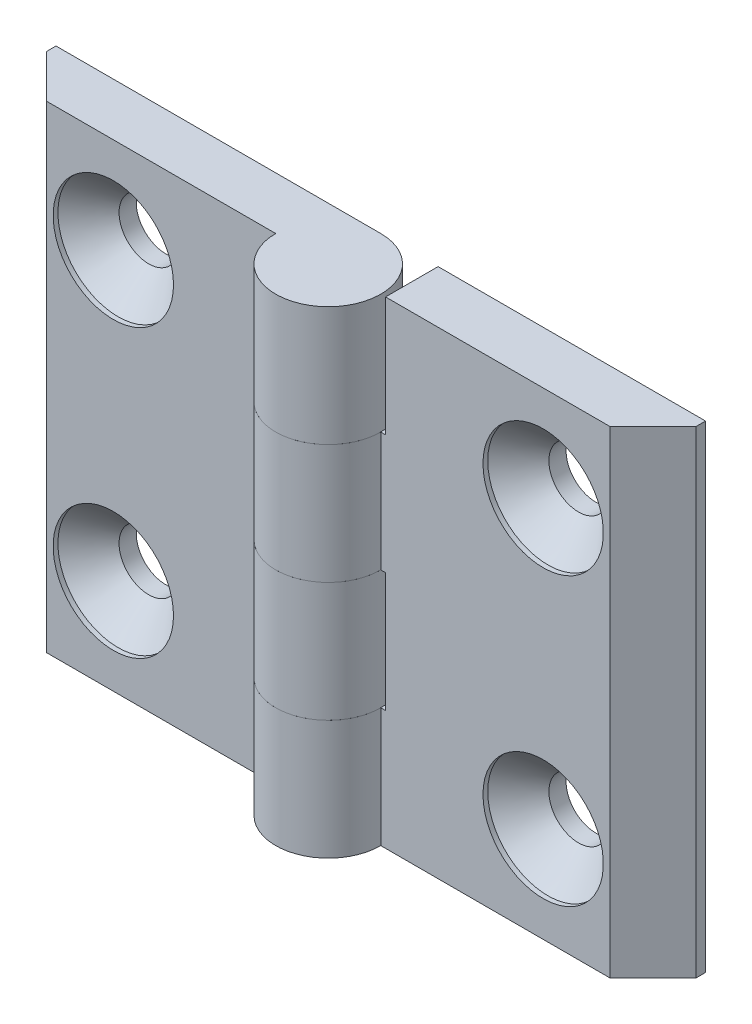
ISO-10303-21;
HEADER;
FILE_DESCRIPTION(('STEP AP214'),'2;1');
FILE_NAME('part.step','',(''),(''),'','','');
FILE_SCHEMA(('AUTOMOTIVE_DESIGN { 1 0 10303 214 1 1 1 1 }'));
ENDSEC;
DATA;
#1=APPLICATION_CONTEXT('core data for automotive mechanical design processes');
#2=APPLICATION_PROTOCOL_DEFINITION('international standard','automotive_design',2000,#1);
#3=PRODUCT_CONTEXT('',#1,'mechanical');
#4=PRODUCT('Part','Part','',(#3));
#5=PRODUCT_RELATED_PRODUCT_CATEGORY('part','',(#4));
#6=PRODUCT_DEFINITION_FORMATION('','',#4);
#7=PRODUCT_DEFINITION_CONTEXT('part definition',#1,'design');
#8=PRODUCT_DEFINITION('design','',#6,#7);
#9=PRODUCT_DEFINITION_SHAPE('','',#8);
#10=(LENGTH_UNIT() NAMED_UNIT(*) SI_UNIT(.MILLI.,.METRE.));
#11=(NAMED_UNIT(*) PLANE_ANGLE_UNIT() SI_UNIT($,.RADIAN.));
#12=(NAMED_UNIT(*) SI_UNIT($,.STERADIAN.) SOLID_ANGLE_UNIT());
#13=UNCERTAINTY_MEASURE_WITH_UNIT(LENGTH_MEASURE(1.E-05),#10,'distance_accuracy_value','');
#14=(GEOMETRIC_REPRESENTATION_CONTEXT(3) GLOBAL_UNCERTAINTY_ASSIGNED_CONTEXT((#13)) GLOBAL_UNIT_ASSIGNED_CONTEXT((#10,
#11,#12)) REPRESENTATION_CONTEXT('',''));
#15=CARTESIAN_POINT('',(0.,0.,0.));
#16=DIRECTION('',(0.,0.,1.));
#17=DIRECTION('',(1.,0.,0.));
#18=AXIS2_PLACEMENT_3D('',#15,#16,#17);
#19=CARTESIAN_POINT('',(0.,-25.,0.));
#20=DIRECTION('',(0.,1.,0.));
#21=DIRECTION('',(0.,0.,-1.));
#22=AXIS2_PLACEMENT_3D('',#19,#20,#21);
#23=CYLINDRICAL_SURFACE('',#22,5.5);
#24=DIRECTION('',(0.,1.,0.));
#25=VECTOR('',#24,1.);
#26=CARTESIAN_POINT('',(5.5,-25.,0.));
#27=LINE('',#26,#25);
#28=CARTESIAN_POINT('',(5.5,-25.,0.));
#29=VERTEX_POINT('',#28);
#30=CARTESIAN_POINT('',(5.5,-12.5,0.));
#31=VERTEX_POINT('',#30);
#32=EDGE_CURVE('E194',#29,#31,#27,.T.);
#33=ORIENTED_EDGE('',*,*,#32,.T.);
#34=CARTESIAN_POINT('',(0.,-12.5,0.));
#35=DIRECTION('',(0.,-1.,0.));
#36=DIRECTION('',(0.,0.,1.));
#37=AXIS2_PLACEMENT_3D('',#34,#35,#36);
#38=CIRCLE('',#37,5.5);
#39=CARTESIAN_POINT('',(0.,-12.5,-5.5));
#40=VERTEX_POINT('',#39);
#41=EDGE_CURVE('E171',#31,#40,#38,.T.);
#42=ORIENTED_EDGE('',*,*,#41,.T.);
#43=DIRECTION('',(0.,1.,0.));
#44=VECTOR('',#43,1.);
#45=CARTESIAN_POINT('',(0.,-25.,-5.5));
#46=LINE('',#45,#44);
#47=CARTESIAN_POINT('',(0.,-25.,-5.5));
#48=VERTEX_POINT('',#47);
#49=EDGE_CURVE('E207',#48,#40,#46,.T.);
#50=ORIENTED_EDGE('',*,*,#49,.F.);
#51=CARTESIAN_POINT('',(0.,-25.,0.));
#52=DIRECTION('',(0.,-1.,0.));
#53=DIRECTION('',(0.,0.,1.));
#54=AXIS2_PLACEMENT_3D('',#51,#52,#53);
#55=CIRCLE('',#54,5.5);
#56=EDGE_CURVE('E174',#29,#48,#55,.T.);
#57=ORIENTED_EDGE('',*,*,#56,.F.);
#58=EDGE_LOOP('',(#33,#42,#50,#57));
#59=FACE_BOUND('',#58,.T.);
#60=ADVANCED_FACE('F45',(#59),#23,.T.);
#61=CARTESIAN_POINT('',(0.,0.,-5.5));
#62=VERTEX_POINT('',#61);
#63=CARTESIAN_POINT('',(0.,12.5,-5.5));
#64=VERTEX_POINT('',#63);
#65=EDGE_CURVE('E206',#62,#64,#46,.T.);
#66=ORIENTED_EDGE('',*,*,#65,.F.);
#67=CARTESIAN_POINT('',(0.,0.,0.));
#68=DIRECTION('',(0.,1.,0.));
#69=DIRECTION('',(0.,0.,-1.));
#70=AXIS2_PLACEMENT_3D('',#67,#68,#69);
#71=CIRCLE('',#70,5.5);
#72=CARTESIAN_POINT('',(5.5,0.,0.));
#73=VERTEX_POINT('',#72);
#74=EDGE_CURVE('E142',#62,#73,#71,.T.);
#75=ORIENTED_EDGE('',*,*,#74,.T.);
#76=CARTESIAN_POINT('',(5.5,12.5,0.));
#77=VERTEX_POINT('',#76);
#78=EDGE_CURVE('E186',#73,#77,#27,.T.);
#79=ORIENTED_EDGE('',*,*,#78,.T.);
#80=CARTESIAN_POINT('',(0.,12.5,0.));
#81=DIRECTION('',(0.,-1.,0.));
#82=DIRECTION('',(1.,0.,0.));
#83=AXIS2_PLACEMENT_3D('',#80,#81,#82);
#84=CIRCLE('',#83,5.5);
#85=EDGE_CURVE('E168',#77,#64,#84,.T.);
#86=ORIENTED_EDGE('',*,*,#85,.T.);
#87=EDGE_LOOP('',(#66,#75,#79,#86));
#88=FACE_BOUND('',#87,.T.);
#89=ADVANCED_FACE('F47',(#88),#23,.T.);
#90=CARTESIAN_POINT('',(0.,-25.,-5.5));
#91=DIRECTION('',(0.,0.,1.));
#92=DIRECTION('',(-1.,0.,0.));
#93=AXIS2_PLACEMENT_3D('',#90,#91,#92);
#94=PLANE('',#93);
#95=CARTESIAN_POINT('',(22.5,-15.,-5.50000000000017));
#96=DIRECTION('',(0.,0.,1.));
#97=DIRECTION('',(-1.,0.,0.));
#98=AXIS2_PLACEMENT_3D('',#95,#96,#97);
#99=CIRCLE('',#98,3.1);
#100=CARTESIAN_POINT('',(19.4,-15.,-5.50000000000014));
#101=VERTEX_POINT('',#100);
#102=EDGE_CURVE('E377',#101,#101,#99,.T.);
#103=ORIENTED_EDGE('',*,*,#102,.T.);
#104=EDGE_LOOP('',(#103));
#105=FACE_BOUND('',#104,.T.);
#106=CARTESIAN_POINT('',(22.5,15.,-5.50000000000017));
#107=DIRECTION('',(0.,0.,1.));
#108=DIRECTION('',(-1.,0.,0.));
#109=AXIS2_PLACEMENT_3D('',#106,#107,#108);
#110=CIRCLE('',#109,3.1);
#111=CARTESIAN_POINT('',(19.4,15.,-5.50000000000014));
#112=VERTEX_POINT('',#111);
#113=EDGE_CURVE('E155',#112,#112,#110,.T.);
#114=ORIENTED_EDGE('',*,*,#113,.T.);
#115=EDGE_LOOP('',(#114));
#116=FACE_BOUND('',#115,.T.);
#117=ORIENTED_EDGE('',*,*,#49,.T.);
#118=DIRECTION('',(1.,0.,0.));
#119=VECTOR('',#118,1.);
#120=CARTESIAN_POINT('',(5.99999999999996,-12.5,-5.50000000000004));
#121=LINE('',#120,#119);
#122=CARTESIAN_POINT('',(5.99999999999996,-12.5,-5.50000000000004));
#123=VERTEX_POINT('',#122);
#124=EDGE_CURVE('E137',#40,#123,#121,.T.);
#125=ORIENTED_EDGE('',*,*,#124,.T.);
#126=DIRECTION('',(0.,1.,0.));
#127=VECTOR('',#126,1.);
#128=CARTESIAN_POINT('',(5.99999999999996,-12.5,-5.50000000000004));
#129=LINE('',#128,#127);
#130=CARTESIAN_POINT('',(5.99999999999996,0.,-5.50000000000004));
#131=VERTEX_POINT('',#130);
#132=EDGE_CURVE('E132',#123,#131,#129,.T.);
#133=ORIENTED_EDGE('',*,*,#132,.T.);
#134=DIRECTION('',(-1.,0.,0.));
#135=VECTOR('',#134,1.);
#136=CARTESIAN_POINT('',(5.99999999999996,0.,-5.50000000000004));
#137=LINE('',#136,#135);
#138=EDGE_CURVE('E140',#131,#62,#137,.T.);
#139=ORIENTED_EDGE('',*,*,#138,.T.);
#140=ORIENTED_EDGE('',*,*,#65,.T.);
#141=DIRECTION('',(1.,0.,0.));
#142=VECTOR('',#141,1.);
#143=CARTESIAN_POINT('',(-5.50000000000004,12.5,-5.49999999999996));
#144=LINE('',#143,#142);
#145=CARTESIAN_POINT('',(5.99999999999996,12.5,-5.50000000000004));
#146=VERTEX_POINT('',#145);
#147=EDGE_CURVE('E160',#64,#146,#144,.T.);
#148=ORIENTED_EDGE('',*,*,#147,.T.);
#149=DIRECTION('',(0.,1.,0.));
#150=VECTOR('',#149,1.);
#151=CARTESIAN_POINT('',(5.99999999999996,25.,-5.50000000000004));
#152=LINE('',#151,#150);
#153=CARTESIAN_POINT('',(5.99999999999996,25.,-5.50000000000004));
#154=VERTEX_POINT('',#153);
#155=EDGE_CURVE('E163',#146,#154,#152,.T.);
#156=ORIENTED_EDGE('',*,*,#155,.T.);
#157=DIRECTION('',(1.,0.,0.));
#158=VECTOR('',#157,1.);
#159=CARTESIAN_POINT('',(0.,25.,-5.5));
#160=LINE('',#159,#158);
#161=CARTESIAN_POINT('',(34.,25.,-5.50000000000025));
#162=VERTEX_POINT('',#161);
#163=EDGE_CURVE('E173',#154,#162,#160,.T.);
#164=ORIENTED_EDGE('',*,*,#163,.T.);
#165=DIRECTION('',(0.,1.,0.));
#166=VECTOR('',#165,1.);
#167=CARTESIAN_POINT('',(34.,-25.,-5.50000000000025));
#168=LINE('',#167,#166);
#169=CARTESIAN_POINT('',(34.,-25.,-5.50000000000025));
#170=VERTEX_POINT('',#169);
#171=EDGE_CURVE('E203',#170,#162,#168,.T.);
#172=ORIENTED_EDGE('',*,*,#171,.F.);
#173=DIRECTION('',(1.,0.,0.));
#174=VECTOR('',#173,1.);
#175=CARTESIAN_POINT('',(0.,-25.,-5.5));
#176=LINE('',#175,#174);
#177=EDGE_CURVE('E177',#48,#170,#176,.T.);
#178=ORIENTED_EDGE('',*,*,#177,.F.);
#179=EDGE_LOOP('',(#117,#125,#133,#139,#140,#148,#156,#164,#172,#178));
#180=FACE_BOUND('',#179,.T.);
#181=ADVANCED_FACE('F148',(#105,#116,#180),#94,.F.);
#182=CARTESIAN_POINT('',(34.,-25.,-5.50000000000025));
#183=DIRECTION('',(-1.,0.,0.));
#184=DIRECTION('',(0.,0.,-1.));
#185=AXIS2_PLACEMENT_3D('',#182,#183,#184);
#186=PLANE('',#185);
#187=DIRECTION('',(0.,0.,1.));
#188=VECTOR('',#187,1.);
#189=CARTESIAN_POINT('',(34.,25.,-5.50000000000025));
#190=LINE('',#189,#188);
#191=CARTESIAN_POINT('',(34.,25.,-4.50000000000025));
#192=VERTEX_POINT('',#191);
#193=EDGE_CURVE('E188',#162,#192,#190,.T.);
#194=ORIENTED_EDGE('',*,*,#193,.T.);
#195=DIRECTION('',(0.,1.,0.));
#196=VECTOR('',#195,1.);
#197=CARTESIAN_POINT('',(34.,-25.,-4.50000000000025));
#198=LINE('',#197,#196);
#199=CARTESIAN_POINT('',(34.,-25.,-4.50000000000025));
#200=VERTEX_POINT('',#199);
#201=EDGE_CURVE('E200',#200,#192,#198,.T.);
#202=ORIENTED_EDGE('',*,*,#201,.F.);
#203=DIRECTION('',(0.,0.,1.));
#204=VECTOR('',#203,1.);
#205=CARTESIAN_POINT('',(34.,-25.,-5.50000000000025));
#206=LINE('',#205,#204);
#207=EDGE_CURVE('E180',#170,#200,#206,.T.);
#208=ORIENTED_EDGE('',*,*,#207,.F.);
#209=ORIENTED_EDGE('',*,*,#171,.T.);
#210=EDGE_LOOP('',(#194,#202,#208,#209));
#211=FACE_BOUND('',#210,.T.);
#212=ADVANCED_FACE('F237',(#211),#186,.F.);
#213=CARTESIAN_POINT('',(34.,-25.,-4.50000000000025));
#214=DIRECTION('',(-0.707106781186549,0.,-0.707106781186546));
#215=DIRECTION('',(0.707106781186546,0.,-0.707106781186549));
#216=AXIS2_PLACEMENT_3D('',#213,#214,#215);
#217=PLANE('',#216);
#218=DIRECTION('',(-0.707106781186546,0.,0.707106781186549));
#219=VECTOR('',#218,1.);
#220=CARTESIAN_POINT('',(34.,25.,-4.50000000000025));
#221=LINE('',#220,#219);
#222=CARTESIAN_POINT('',(29.5,25.,-2.20463346970764E-13));
#223=VERTEX_POINT('',#222);
#224=EDGE_CURVE('E190',#192,#223,#221,.T.);
#225=ORIENTED_EDGE('',*,*,#224,.T.);
#226=DIRECTION('',(0.,1.,0.));
#227=VECTOR('',#226,1.);
#228=CARTESIAN_POINT('',(29.5,-25.,-2.20463346970764E-13));
#229=LINE('',#228,#227);
#230=CARTESIAN_POINT('',(29.5,-25.,-2.20463346970764E-13));
#231=VERTEX_POINT('',#230);
#232=EDGE_CURVE('E197',#231,#223,#229,.T.);
#233=ORIENTED_EDGE('',*,*,#232,.F.);
#234=DIRECTION('',(-0.707106781186546,0.,0.707106781186549));
#235=VECTOR('',#234,1.);
#236=CARTESIAN_POINT('',(34.,-25.,-4.50000000000025));
#237=LINE('',#236,#235);
#238=EDGE_CURVE('E182',#200,#231,#237,.T.);
#239=ORIENTED_EDGE('',*,*,#238,.F.);
#240=ORIENTED_EDGE('',*,*,#201,.T.);
#241=EDGE_LOOP('',(#225,#233,#239,#240));
#242=FACE_BOUND('',#241,.T.);
#243=ADVANCED_FACE('F234',(#242),#217,.F.);
#244=CARTESIAN_POINT('',(29.5,-25.,-2.20463346970764E-13));
#245=DIRECTION('',(0.,0.,-1.));
#246=DIRECTION('',(1.,0.,0.));
#247=AXIS2_PLACEMENT_3D('',#244,#245,#246);
#248=PLANE('',#247);
#249=CARTESIAN_POINT('',(22.5,-15.,-1.68355321874764E-13));
#250=DIRECTION('',(0.,0.,1.));
#251=DIRECTION('',(-1.,0.,0.));
#252=AXIS2_PLACEMENT_3D('',#249,#250,#251);
#253=CIRCLE('',#252,6.3);
#254=CARTESIAN_POINT('',(16.2,-15.,-1.21276547071489E-13));
#255=VERTEX_POINT('',#254);
#256=EDGE_CURVE('E370',#255,#255,#253,.T.);
#257=ORIENTED_EDGE('',*,*,#256,.F.);
#258=EDGE_LOOP('',(#257));
#259=FACE_BOUND('',#258,.T.);
#260=CARTESIAN_POINT('',(22.5,15.,-1.68355321874764E-13));
#261=DIRECTION('',(0.,0.,1.));
#262=DIRECTION('',(-1.,0.,0.));
#263=AXIS2_PLACEMENT_3D('',#260,#261,#262);
#264=CIRCLE('',#263,6.3);
#265=CARTESIAN_POINT('',(16.2,15.,-1.21276547071489E-13));
#266=VERTEX_POINT('',#265);
#267=EDGE_CURVE('E379',#266,#266,#264,.T.);
#268=ORIENTED_EDGE('',*,*,#267,.F.);
#269=EDGE_LOOP('',(#268));
#270=FACE_BOUND('',#269,.T.);
#271=DIRECTION('',(0.,-1.,0.));
#272=VECTOR('',#271,1.);
#273=CARTESIAN_POINT('',(6.,-25.,0.));
#274=LINE('',#273,#272);
#275=CARTESIAN_POINT('',(6.,0.,0.));
#276=VERTEX_POINT('',#275);
#277=CARTESIAN_POINT('',(6.,-12.5,0.));
#278=VERTEX_POINT('',#277);
#279=EDGE_CURVE('E53',#276,#278,#274,.T.);
#280=ORIENTED_EDGE('',*,*,#279,.T.);
#281=DIRECTION('',(-1.,0.,0.));
#282=VECTOR('',#281,1.);
#283=CARTESIAN_POINT('',(29.5,-12.5,-2.20463346970764E-13));
#284=LINE('',#283,#282);
#285=EDGE_CURVE('E12',#278,#31,#284,.T.);
#286=ORIENTED_EDGE('',*,*,#285,.T.);
#287=ORIENTED_EDGE('',*,*,#32,.F.);
#288=DIRECTION('',(-1.,0.,0.));
#289=VECTOR('',#288,1.);
#290=CARTESIAN_POINT('',(29.5,-25.,-2.20463346970764E-13));
#291=LINE('',#290,#289);
#292=EDGE_CURVE('E184',#231,#29,#291,.T.);
#293=ORIENTED_EDGE('',*,*,#292,.F.);
#294=ORIENTED_EDGE('',*,*,#232,.T.);
#295=DIRECTION('',(-1.,0.,0.));
#296=VECTOR('',#295,1.);
#297=CARTESIAN_POINT('',(29.5,25.,-2.20463346970764E-13));
#298=LINE('',#297,#296);
#299=CARTESIAN_POINT('',(6.00000000000001,25.,0.));
#300=VERTEX_POINT('',#299);
#301=EDGE_CURVE('E178',#223,#300,#298,.T.);
#302=ORIENTED_EDGE('',*,*,#301,.T.);
#303=DIRECTION('',(0.,-1.,0.));
#304=VECTOR('',#303,1.);
#305=CARTESIAN_POINT('',(5.99999999999998,-25.,0.));
#306=LINE('',#305,#304);
#307=CARTESIAN_POINT('',(6.,12.5,0.));
#308=VERTEX_POINT('',#307);
#309=EDGE_CURVE('E68',#300,#308,#306,.T.);
#310=ORIENTED_EDGE('',*,*,#309,.T.);
#311=DIRECTION('',(-1.,0.,0.));
#312=VECTOR('',#311,1.);
#313=CARTESIAN_POINT('',(29.5,12.5,-2.20463346970764E-13));
#314=LINE('',#313,#312);
#315=EDGE_CURVE('E209',#308,#77,#314,.T.);
#316=ORIENTED_EDGE('',*,*,#315,.T.);
#317=ORIENTED_EDGE('',*,*,#78,.F.);
#318=DIRECTION('',(1.,0.,0.));
#319=VECTOR('',#318,1.);
#320=CARTESIAN_POINT('',(29.5,0.,-2.20463346970764E-13));
#321=LINE('',#320,#319);
#322=EDGE_CURVE('E212',#73,#276,#321,.T.);
#323=ORIENTED_EDGE('',*,*,#322,.T.);
#324=EDGE_LOOP('',(#280,#286,#287,#293,#294,#302,#310,#316,#317,#323));
#325=FACE_BOUND('',#324,.T.);
#326=ADVANCED_FACE('F214',(#259,#270,#325),#248,.F.);
#327=CARTESIAN_POINT('',(0.,-25.,0.));
#328=DIRECTION('',(0.,-1.,0.));
#329=DIRECTION('',(0.,0.,1.));
#330=AXIS2_PLACEMENT_3D('',#327,#328,#329);
#331=PLANE('',#330);
#332=ORIENTED_EDGE('',*,*,#56,.T.);
#333=ORIENTED_EDGE('',*,*,#177,.T.);
#334=ORIENTED_EDGE('',*,*,#207,.T.);
#335=ORIENTED_EDGE('',*,*,#238,.T.);
#336=ORIENTED_EDGE('',*,*,#292,.T.);
#337=EDGE_LOOP('',(#332,#333,#334,#335,#336));
#338=FACE_BOUND('',#337,.T.);
#339=ADVANCED_FACE('F243',(#338),#331,.T.);
#340=CARTESIAN_POINT('',(0.,25.,0.));
#341=DIRECTION('',(0.,-1.,0.));
#342=DIRECTION('',(0.,0.,1.));
#343=AXIS2_PLACEMENT_3D('',#340,#341,#342);
#344=PLANE('',#343);
#345=ORIENTED_EDGE('',*,*,#163,.F.);
#346=DIRECTION('',(0.,0.,1.));
#347=VECTOR('',#346,1.);
#348=CARTESIAN_POINT('',(5.99999999999996,25.,-5.50000000000004));
#349=LINE('',#348,#347);
#350=EDGE_CURVE('E150',#154,#300,#349,.T.);
#351=ORIENTED_EDGE('',*,*,#350,.T.);
#352=ORIENTED_EDGE('',*,*,#301,.F.);
#353=ORIENTED_EDGE('',*,*,#224,.F.);
#354=ORIENTED_EDGE('',*,*,#193,.F.);
#355=EDGE_LOOP('',(#345,#351,#352,#353,#354));
#356=FACE_BOUND('',#355,.T.);
#357=ADVANCED_FACE('F227',(#356),#344,.F.);
#358=CARTESIAN_POINT('',(-5.50000000000004,12.5,-5.49999999999996));
#359=DIRECTION('',(0.,-1.,0.));
#360=DIRECTION('',(1.,0.,0.));
#361=AXIS2_PLACEMENT_3D('',#358,#359,#360);
#362=PLANE('',#361);
#363=ORIENTED_EDGE('',*,*,#85,.F.);
#364=ORIENTED_EDGE('',*,*,#315,.F.);
#365=DIRECTION('',(0.,0.,1.));
#366=VECTOR('',#365,1.);
#367=CARTESIAN_POINT('',(5.99999999999996,12.5,-5.50000000000004));
#368=LINE('',#367,#366);
#369=EDGE_CURVE('E152',#146,#308,#368,.T.);
#370=ORIENTED_EDGE('',*,*,#369,.F.);
#371=ORIENTED_EDGE('',*,*,#147,.F.);
#372=EDGE_LOOP('',(#363,#364,#370,#371));
#373=FACE_BOUND('',#372,.T.);
#374=ADVANCED_FACE('F223',(#373),#362,.F.);
#375=CARTESIAN_POINT('',(5.99999999999996,25.,-5.50000000000004));
#376=DIRECTION('',(1.,0.,0.));
#377=DIRECTION('',(0.,1.,0.));
#378=AXIS2_PLACEMENT_3D('',#375,#376,#377);
#379=PLANE('',#378);
#380=ORIENTED_EDGE('',*,*,#350,.F.);
#381=ORIENTED_EDGE('',*,*,#155,.F.);
#382=ORIENTED_EDGE('',*,*,#369,.T.);
#383=ORIENTED_EDGE('',*,*,#309,.F.);
#384=EDGE_LOOP('',(#380,#381,#382,#383));
#385=FACE_BOUND('',#384,.T.);
#386=ADVANCED_FACE('F224',(#385),#379,.F.);
#387=CARTESIAN_POINT('',(5.99999999999996,-12.5,-5.50000000000004));
#388=DIRECTION('',(1.,0.,0.));
#389=DIRECTION('',(0.,1.,0.));
#390=AXIS2_PLACEMENT_3D('',#387,#388,#389);
#391=PLANE('',#390);
#392=DIRECTION('',(0.,0.,1.));
#393=VECTOR('',#392,1.);
#394=CARTESIAN_POINT('',(5.99999999999996,0.,-5.50000000000004));
#395=LINE('',#394,#393);
#396=EDGE_CURVE('E60',#131,#276,#395,.T.);
#397=ORIENTED_EDGE('',*,*,#396,.F.);
#398=ORIENTED_EDGE('',*,*,#132,.F.);
#399=DIRECTION('',(0.,0.,1.));
#400=VECTOR('',#399,1.);
#401=CARTESIAN_POINT('',(5.99999999999996,-12.5,-5.50000000000004));
#402=LINE('',#401,#400);
#403=EDGE_CURVE('E136',#123,#278,#402,.T.);
#404=ORIENTED_EDGE('',*,*,#403,.T.);
#405=ORIENTED_EDGE('',*,*,#279,.F.);
#406=EDGE_LOOP('',(#397,#398,#404,#405));
#407=FACE_BOUND('',#406,.T.);
#408=ADVANCED_FACE('F129',(#407),#391,.F.);
#409=CARTESIAN_POINT('',(5.99999999999996,-12.5,-5.50000000000004));
#410=DIRECTION('',(0.,-1.,0.));
#411=DIRECTION('',(0.,0.,1.));
#412=AXIS2_PLACEMENT_3D('',#409,#410,#411);
#413=PLANE('',#412);
#414=ORIENTED_EDGE('',*,*,#41,.F.);
#415=ORIENTED_EDGE('',*,*,#285,.F.);
#416=ORIENTED_EDGE('',*,*,#403,.F.);
#417=ORIENTED_EDGE('',*,*,#124,.F.);
#418=EDGE_LOOP('',(#414,#415,#416,#417));
#419=FACE_BOUND('',#418,.T.);
#420=ADVANCED_FACE('F246',(#419),#413,.F.);
#421=CARTESIAN_POINT('',(5.99999999999996,0.,-5.50000000000004));
#422=DIRECTION('',(0.,1.,0.));
#423=DIRECTION('',(0.,0.,-1.));
#424=AXIS2_PLACEMENT_3D('',#421,#422,#423);
#425=PLANE('',#424);
#426=ORIENTED_EDGE('',*,*,#138,.F.);
#427=ORIENTED_EDGE('',*,*,#396,.T.);
#428=ORIENTED_EDGE('',*,*,#322,.F.);
#429=ORIENTED_EDGE('',*,*,#74,.F.);
#430=EDGE_LOOP('',(#426,#427,#428,#429));
#431=FACE_BOUND('',#430,.T.);
#432=ADVANCED_FACE('F141',(#431),#425,.F.);
#433=CARTESIAN_POINT('',(22.5,15.,-1.68138481440267E-13));
#434=DIRECTION('',(0.,0.,1.));
#435=DIRECTION('',(-1.,0.,0.));
#436=AXIS2_PLACEMENT_3D('',#433,#434,#435);
#437=CYLINDRICAL_SURFACE('',#436,3.1);
#438=ORIENTED_EDGE('',*,*,#113,.F.);
#439=EDGE_LOOP('',(#438));
#440=FACE_BOUND('',#439,.T.);
#441=CARTESIAN_POINT('',(22.5,15.,-3.70000000000017));
#442=DIRECTION('',(0.,0.,1.));
#443=DIRECTION('',(-1.,0.,0.));
#444=AXIS2_PLACEMENT_3D('',#441,#442,#443);
#445=CIRCLE('',#444,3.1);
#446=CARTESIAN_POINT('',(19.4,15.,-3.70000000000014));
#447=VERTEX_POINT('',#446);
#448=EDGE_CURVE('E384',#447,#447,#445,.T.);
#449=ORIENTED_EDGE('',*,*,#448,.T.);
#450=EDGE_LOOP('',(#449));
#451=FACE_BOUND('',#450,.T.);
#452=ADVANCED_FACE('F253',(#440,#451),#437,.F.);
#453=CARTESIAN_POINT('',(22.5,15.,-0.500000000000168));
#454=DIRECTION('',(0.,0.,1.));
#455=DIRECTION('',(-1.,0.,0.));
#456=AXIS2_PLACEMENT_3D('',#453,#454,#455);
#457=CONICAL_SURFACE('',#456,6.3,0.785398163397449);
#458=ORIENTED_EDGE('',*,*,#448,.F.);
#459=EDGE_LOOP('',(#458));
#460=FACE_BOUND('',#459,.T.);
#461=CARTESIAN_POINT('',(22.5,15.,-0.500000000000168));
#462=DIRECTION('',(0.,0.,1.));
#463=DIRECTION('',(-1.,0.,0.));
#464=AXIS2_PLACEMENT_3D('',#461,#462,#463);
#465=CIRCLE('',#464,6.3);
#466=CARTESIAN_POINT('',(16.2,15.,-0.500000000000121));
#467=VERTEX_POINT('',#466);
#468=EDGE_CURVE('E382',#467,#467,#465,.T.);
#469=ORIENTED_EDGE('',*,*,#468,.T.);
#470=EDGE_LOOP('',(#469));
#471=FACE_BOUND('',#470,.T.);
#472=ADVANCED_FACE('F311',(#460,#471),#457,.F.);
#473=CARTESIAN_POINT('',(22.5,15.,-1.68138481440267E-13));
#474=DIRECTION('',(0.,0.,1.));
#475=DIRECTION('',(-1.,0.,0.));
#476=AXIS2_PLACEMENT_3D('',#473,#474,#475);
#477=CYLINDRICAL_SURFACE('',#476,6.3);
#478=ORIENTED_EDGE('',*,*,#468,.F.);
#479=EDGE_LOOP('',(#478));
#480=FACE_BOUND('',#479,.T.);
#481=ORIENTED_EDGE('',*,*,#267,.T.);
#482=EDGE_LOOP('',(#481));
#483=FACE_BOUND('',#482,.T.);
#484=ADVANCED_FACE('F320',(#480,#483),#477,.F.);
#485=CARTESIAN_POINT('',(22.5,-15.,-1.68138481440267E-13));
#486=DIRECTION('',(0.,0.,1.));
#487=DIRECTION('',(-1.,0.,0.));
#488=AXIS2_PLACEMENT_3D('',#485,#486,#487);
#489=CYLINDRICAL_SURFACE('',#488,3.1);
#490=ORIENTED_EDGE('',*,*,#102,.F.);
#491=EDGE_LOOP('',(#490));
#492=FACE_BOUND('',#491,.T.);
#493=CARTESIAN_POINT('',(22.5,-15.,-3.70000000000017));
#494=DIRECTION('',(0.,0.,1.));
#495=DIRECTION('',(-1.,0.,0.));
#496=AXIS2_PLACEMENT_3D('',#493,#494,#495);
#497=CIRCLE('',#496,3.1);
#498=CARTESIAN_POINT('',(19.4,-15.,-3.70000000000014));
#499=VERTEX_POINT('',#498);
#500=EDGE_CURVE('E372',#499,#499,#497,.T.);
#501=ORIENTED_EDGE('',*,*,#500,.T.);
#502=EDGE_LOOP('',(#501));
#503=FACE_BOUND('',#502,.T.);
#504=ADVANCED_FACE('F330',(#492,#503),#489,.F.);
#505=CARTESIAN_POINT('',(22.5,-15.,-0.500000000000168));
#506=DIRECTION('',(0.,0.,1.));
#507=DIRECTION('',(-1.,0.,0.));
#508=AXIS2_PLACEMENT_3D('',#505,#506,#507);
#509=CONICAL_SURFACE('',#508,6.3,0.785398163397449);
#510=ORIENTED_EDGE('',*,*,#500,.F.);
#511=EDGE_LOOP('',(#510));
#512=FACE_BOUND('',#511,.T.);
#513=CARTESIAN_POINT('',(22.5,-15.,-0.500000000000168));
#514=DIRECTION('',(0.,0.,1.));
#515=DIRECTION('',(-1.,0.,0.));
#516=AXIS2_PLACEMENT_3D('',#513,#514,#515);
#517=CIRCLE('',#516,6.3);
#518=CARTESIAN_POINT('',(16.2,-15.,-0.500000000000121));
#519=VERTEX_POINT('',#518);
#520=EDGE_CURVE('E367',#519,#519,#517,.T.);
#521=ORIENTED_EDGE('',*,*,#520,.T.);
#522=EDGE_LOOP('',(#521));
#523=FACE_BOUND('',#522,.T.);
#524=ADVANCED_FACE('F340',(#512,#523),#509,.F.);
#525=CARTESIAN_POINT('',(22.5,-15.,-1.68138481440267E-13));
#526=DIRECTION('',(0.,0.,1.));
#527=DIRECTION('',(-1.,0.,0.));
#528=AXIS2_PLACEMENT_3D('',#525,#526,#527);
#529=CYLINDRICAL_SURFACE('',#528,6.3);
#530=ORIENTED_EDGE('',*,*,#520,.F.);
#531=EDGE_LOOP('',(#530));
#532=FACE_BOUND('',#531,.T.);
#533=ORIENTED_EDGE('',*,*,#256,.T.);
#534=EDGE_LOOP('',(#533));
#535=FACE_BOUND('',#534,.T.);
#536=ADVANCED_FACE('F350',(#532,#535),#529,.F.);
#537=CLOSED_SHELL('',(#60,#89,#181,#212,#243,#326,#339,#357,#374,#386,#408,#420,#432,#452,#472,
#484,#504,#524,#536));
#538=MANIFOLD_SOLID_BREP('B2',#537);
#539=CARTESIAN_POINT('',(0.,25.,0.));
#540=DIRECTION('',(0.,-1.,0.));
#541=DIRECTION('',(0.,0.,-1.));
#542=AXIS2_PLACEMENT_3D('',#539,#540,#541);
#543=CYLINDRICAL_SURFACE('',#542,5.5);
#544=DIRECTION('',(0.,-1.,0.));
#545=VECTOR('',#544,1.);
#546=CARTESIAN_POINT('',(-5.5,25.,0.));
#547=LINE('',#546,#545);
#548=CARTESIAN_POINT('',(-5.5,25.,0.));
#549=VERTEX_POINT('',#548);
#550=CARTESIAN_POINT('',(-5.5,12.5,0.));
#551=VERTEX_POINT('',#550);
#552=EDGE_CURVE('E599',#549,#551,#547,.T.);
#553=ORIENTED_EDGE('',*,*,#552,.T.);
#554=CARTESIAN_POINT('',(0.,12.5,0.));
#555=DIRECTION('',(0.,1.,0.));
#556=DIRECTION('',(0.,0.,1.));
#557=AXIS2_PLACEMENT_3D('',#554,#555,#556);
#558=CIRCLE('',#557,5.5);
#559=CARTESIAN_POINT('',(0.,12.5,-5.5));
#560=VERTEX_POINT('',#559);
#561=EDGE_CURVE('E576',#551,#560,#558,.T.);
#562=ORIENTED_EDGE('',*,*,#561,.T.);
#563=DIRECTION('',(0.,-1.,0.));
#564=VECTOR('',#563,1.);
#565=CARTESIAN_POINT('',(0.,25.,-5.5));
#566=LINE('',#565,#564);
#567=CARTESIAN_POINT('',(0.,25.,-5.5));
#568=VERTEX_POINT('',#567);
#569=EDGE_CURVE('E612',#568,#560,#566,.T.);
#570=ORIENTED_EDGE('',*,*,#569,.F.);
#571=CARTESIAN_POINT('',(0.,25.,0.));
#572=DIRECTION('',(0.,1.,0.));
#573=DIRECTION('',(0.,0.,1.));
#574=AXIS2_PLACEMENT_3D('',#571,#572,#573);
#575=CIRCLE('',#574,5.5);
#576=EDGE_CURVE('E579',#549,#568,#575,.T.);
#577=ORIENTED_EDGE('',*,*,#576,.F.);
#578=EDGE_LOOP('',(#553,#562,#570,#577));
#579=FACE_BOUND('',#578,.T.);
#580=ADVANCED_FACE('F450',(#579),#543,.T.);
#581=CARTESIAN_POINT('',(0.,0.,-5.5));
#582=VERTEX_POINT('',#581);
#583=CARTESIAN_POINT('',(0.,-12.5,-5.5));
#584=VERTEX_POINT('',#583);
#585=EDGE_CURVE('E611',#582,#584,#566,.T.);
#586=ORIENTED_EDGE('',*,*,#585,.F.);
#587=CARTESIAN_POINT('',(0.,0.,0.));
#588=DIRECTION('',(0.,-1.,0.));
#589=DIRECTION('',(0.,0.,-1.));
#590=AXIS2_PLACEMENT_3D('',#587,#588,#589);
#591=CIRCLE('',#590,5.5);
#592=CARTESIAN_POINT('',(-5.5,0.,0.));
#593=VERTEX_POINT('',#592);
#594=EDGE_CURVE('E547',#582,#593,#591,.T.);
#595=ORIENTED_EDGE('',*,*,#594,.T.);
#596=CARTESIAN_POINT('',(-5.5,-12.5,0.));
#597=VERTEX_POINT('',#596);
#598=EDGE_CURVE('E591',#593,#597,#547,.T.);
#599=ORIENTED_EDGE('',*,*,#598,.T.);
#600=CARTESIAN_POINT('',(0.,-12.5,0.));
#601=DIRECTION('',(0.,1.,0.));
#602=DIRECTION('',(-1.,0.,0.));
#603=AXIS2_PLACEMENT_3D('',#600,#601,#602);
#604=CIRCLE('',#603,5.5);
#605=EDGE_CURVE('E573',#597,#584,#604,.T.);
#606=ORIENTED_EDGE('',*,*,#605,.T.);
#607=EDGE_LOOP('',(#586,#595,#599,#606));
#608=FACE_BOUND('',#607,.T.);
#609=ADVANCED_FACE('F452',(#608),#543,.T.);
#610=CARTESIAN_POINT('',(0.,25.,-5.5));
#611=DIRECTION('',(0.,0.,1.));
#612=DIRECTION('',(1.,0.,0.));
#613=AXIS2_PLACEMENT_3D('',#610,#611,#612);
#614=PLANE('',#613);
#615=CARTESIAN_POINT('',(-22.5,15.,-5.5));
#616=DIRECTION('',(0.,0.,1.));
#617=DIRECTION('',(1.,0.,0.));
#618=AXIS2_PLACEMENT_3D('',#615,#616,#617);
#619=CIRCLE('',#618,3.1);
#620=CARTESIAN_POINT('',(-19.4,15.,-5.5));
#621=VERTEX_POINT('',#620);
#622=EDGE_CURVE('E796',#621,#621,#619,.T.);
#623=ORIENTED_EDGE('',*,*,#622,.T.);
#624=EDGE_LOOP('',(#623));
#625=FACE_BOUND('',#624,.T.);
#626=CARTESIAN_POINT('',(-22.5,-15.,-5.5));
#627=DIRECTION('',(0.,0.,1.));
#628=DIRECTION('',(1.,0.,0.));
#629=AXIS2_PLACEMENT_3D('',#626,#627,#628);
#630=CIRCLE('',#629,3.1);
#631=CARTESIAN_POINT('',(-19.4,-15.,-5.5));
#632=VERTEX_POINT('',#631);
#633=EDGE_CURVE('E560',#632,#632,#630,.T.);
#634=ORIENTED_EDGE('',*,*,#633,.T.);
#635=EDGE_LOOP('',(#634));
#636=FACE_BOUND('',#635,.T.);
#637=ORIENTED_EDGE('',*,*,#569,.T.);
#638=DIRECTION('',(-1.,0.,0.));
#639=VECTOR('',#638,1.);
#640=CARTESIAN_POINT('',(-6.,12.5,-5.5));
#641=LINE('',#640,#639);
#642=CARTESIAN_POINT('',(-6.,12.5,-5.5));
#643=VERTEX_POINT('',#642);
#644=EDGE_CURVE('E542',#560,#643,#641,.T.);
#645=ORIENTED_EDGE('',*,*,#644,.T.);
#646=DIRECTION('',(0.,-1.,0.));
#647=VECTOR('',#646,1.);
#648=CARTESIAN_POINT('',(-6.,12.5,-5.5));
#649=LINE('',#648,#647);
#650=CARTESIAN_POINT('',(-6.,0.,-5.5));
#651=VERTEX_POINT('',#650);
#652=EDGE_CURVE('E537',#643,#651,#649,.T.);
#653=ORIENTED_EDGE('',*,*,#652,.T.);
#654=DIRECTION('',(1.,0.,0.));
#655=VECTOR('',#654,1.);
#656=CARTESIAN_POINT('',(-6.,0.,-5.5));
#657=LINE('',#656,#655);
#658=EDGE_CURVE('E545',#651,#582,#657,.T.);
#659=ORIENTED_EDGE('',*,*,#658,.T.);
#660=ORIENTED_EDGE('',*,*,#585,.T.);
#661=DIRECTION('',(-1.,0.,0.));
#662=VECTOR('',#661,1.);
#663=CARTESIAN_POINT('',(5.5,-12.5,-5.5));
#664=LINE('',#663,#662);
#665=CARTESIAN_POINT('',(-6.,-12.5,-5.5));
#666=VERTEX_POINT('',#665);
#667=EDGE_CURVE('E565',#584,#666,#664,.T.);
#668=ORIENTED_EDGE('',*,*,#667,.T.);
#669=DIRECTION('',(0.,-1.,0.));
#670=VECTOR('',#669,1.);
#671=CARTESIAN_POINT('',(-6.,-25.,-5.5));
#672=LINE('',#671,#670);
#673=CARTESIAN_POINT('',(-6.,-25.,-5.5));
#674=VERTEX_POINT('',#673);
#675=EDGE_CURVE('E568',#666,#674,#672,.T.);
#676=ORIENTED_EDGE('',*,*,#675,.T.);
#677=DIRECTION('',(-1.,0.,0.));
#678=VECTOR('',#677,1.);
#679=CARTESIAN_POINT('',(0.,-25.,-5.5));
#680=LINE('',#679,#678);
#681=CARTESIAN_POINT('',(-34.,-25.,-5.5));
#682=VERTEX_POINT('',#681);
#683=EDGE_CURVE('E578',#674,#682,#680,.T.);
#684=ORIENTED_EDGE('',*,*,#683,.T.);
#685=DIRECTION('',(0.,-1.,0.));
#686=VECTOR('',#685,1.);
#687=CARTESIAN_POINT('',(-34.,25.,-5.5));
#688=LINE('',#687,#686);
#689=CARTESIAN_POINT('',(-34.,25.,-5.5));
#690=VERTEX_POINT('',#689);
#691=EDGE_CURVE('E608',#690,#682,#688,.T.);
#692=ORIENTED_EDGE('',*,*,#691,.F.);
#693=DIRECTION('',(-1.,0.,0.));
#694=VECTOR('',#693,1.);
#695=CARTESIAN_POINT('',(0.,25.,-5.5));
#696=LINE('',#695,#694);
#697=EDGE_CURVE('E582',#568,#690,#696,.T.);
#698=ORIENTED_EDGE('',*,*,#697,.F.);
#699=EDGE_LOOP('',(#637,#645,#653,#659,#660,#668,#676,#684,#692,#698));
#700=FACE_BOUND('',#699,.T.);
#701=ADVANCED_FACE('F553',(#625,#636,#700),#614,.F.);
#702=CARTESIAN_POINT('',(-34.,25.,-5.5));
#703=DIRECTION('',(1.,0.,0.));
#704=DIRECTION('',(0.,0.,-1.));
#705=AXIS2_PLACEMENT_3D('',#702,#703,#704);
#706=PLANE('',#705);
#707=DIRECTION('',(0.,0.,1.));
#708=VECTOR('',#707,1.);
#709=CARTESIAN_POINT('',(-34.,-25.,-5.5));
#710=LINE('',#709,#708);
#711=CARTESIAN_POINT('',(-34.,-25.,-4.5));
#712=VERTEX_POINT('',#711);
#713=EDGE_CURVE('E593',#682,#712,#710,.T.);
#714=ORIENTED_EDGE('',*,*,#713,.T.);
#715=DIRECTION('',(0.,-1.,0.));
#716=VECTOR('',#715,1.);
#717=CARTESIAN_POINT('',(-34.,25.,-4.5));
#718=LINE('',#717,#716);
#719=CARTESIAN_POINT('',(-34.,25.,-4.5));
#720=VERTEX_POINT('',#719);
#721=EDGE_CURVE('E605',#720,#712,#718,.T.);
#722=ORIENTED_EDGE('',*,*,#721,.F.);
#723=DIRECTION('',(0.,0.,1.));
#724=VECTOR('',#723,1.);
#725=CARTESIAN_POINT('',(-34.,25.,-5.5));
#726=LINE('',#725,#724);
#727=EDGE_CURVE('E585',#690,#720,#726,.T.);
#728=ORIENTED_EDGE('',*,*,#727,.F.);
#729=ORIENTED_EDGE('',*,*,#691,.T.);
#730=EDGE_LOOP('',(#714,#722,#728,#729));
#731=FACE_BOUND('',#730,.T.);
#732=ADVANCED_FACE('F642',(#731),#706,.F.);
#733=CARTESIAN_POINT('',(-34.,25.,-4.5));
#734=DIRECTION('',(0.707106781186544,0.,-0.707106781186552));
#735=DIRECTION('',(-0.707106781186551,0.,-0.707106781186544));
#736=AXIS2_PLACEMENT_3D('',#733,#734,#735);
#737=PLANE('',#736);
#738=DIRECTION('',(0.707106781186552,0.,0.707106781186544));
#739=VECTOR('',#738,1.);
#740=CARTESIAN_POINT('',(-34.,-25.,-4.5));
#741=LINE('',#740,#739);
#742=CARTESIAN_POINT('',(-29.5,-25.,0.));
#743=VERTEX_POINT('',#742);
#744=EDGE_CURVE('E595',#712,#743,#741,.T.);
#745=ORIENTED_EDGE('',*,*,#744,.T.);
#746=DIRECTION('',(0.,-1.,0.));
#747=VECTOR('',#746,1.);
#748=CARTESIAN_POINT('',(-29.5,25.,0.));
#749=LINE('',#748,#747);
#750=CARTESIAN_POINT('',(-29.5,25.,0.));
#751=VERTEX_POINT('',#750);
#752=EDGE_CURVE('E602',#751,#743,#749,.T.);
#753=ORIENTED_EDGE('',*,*,#752,.F.);
#754=DIRECTION('',(0.707106781186552,0.,0.707106781186544));
#755=VECTOR('',#754,1.);
#756=CARTESIAN_POINT('',(-34.,25.,-4.5));
#757=LINE('',#756,#755);
#758=EDGE_CURVE('E587',#720,#751,#757,.T.);
#759=ORIENTED_EDGE('',*,*,#758,.F.);
#760=ORIENTED_EDGE('',*,*,#721,.T.);
#761=EDGE_LOOP('',(#745,#753,#759,#760));
#762=FACE_BOUND('',#761,.T.);
#763=ADVANCED_FACE('F639',(#762),#737,.F.);
#764=CARTESIAN_POINT('',(-29.5,25.,0.));
#765=DIRECTION('',(0.,0.,-1.));
#766=DIRECTION('',(-1.,0.,0.));
#767=AXIS2_PLACEMENT_3D('',#764,#765,#766);
#768=PLANE('',#767);
#769=CARTESIAN_POINT('',(-22.5,15.,0.));
#770=DIRECTION('',(0.,0.,1.));
#771=DIRECTION('',(1.,0.,0.));
#772=AXIS2_PLACEMENT_3D('',#769,#770,#771);
#773=CIRCLE('',#772,6.3);
#774=CARTESIAN_POINT('',(-16.2,15.,0.));
#775=VERTEX_POINT('',#774);
#776=EDGE_CURVE('E789',#775,#775,#773,.T.);
#777=ORIENTED_EDGE('',*,*,#776,.F.);
#778=EDGE_LOOP('',(#777));
#779=FACE_BOUND('',#778,.T.);
#780=CARTESIAN_POINT('',(-22.5,-15.,0.));
#781=DIRECTION('',(0.,0.,1.));
#782=DIRECTION('',(1.,0.,0.));
#783=AXIS2_PLACEMENT_3D('',#780,#781,#782);
#784=CIRCLE('',#783,6.3);
#785=CARTESIAN_POINT('',(-16.2,-15.,0.));
#786=VERTEX_POINT('',#785);
#787=EDGE_CURVE('E798',#786,#786,#784,.T.);
#788=ORIENTED_EDGE('',*,*,#787,.F.);
#789=EDGE_LOOP('',(#788));
#790=FACE_BOUND('',#789,.T.);
#791=DIRECTION('',(0.,1.,0.));
#792=VECTOR('',#791,1.);
#793=CARTESIAN_POINT('',(-6.,25.,0.));
#794=LINE('',#793,#792);
#795=CARTESIAN_POINT('',(-6.,0.,0.));
#796=VERTEX_POINT('',#795);
#797=CARTESIAN_POINT('',(-6.,12.5,0.));
#798=VERTEX_POINT('',#797);
#799=EDGE_CURVE('E458',#796,#798,#794,.T.);
#800=ORIENTED_EDGE('',*,*,#799,.T.);
#801=DIRECTION('',(1.,0.,0.));
#802=VECTOR('',#801,1.);
#803=CARTESIAN_POINT('',(-29.5,12.5,0.));
#804=LINE('',#803,#802);
#805=EDGE_CURVE('E43',#798,#551,#804,.T.);
#806=ORIENTED_EDGE('',*,*,#805,.T.);
#807=ORIENTED_EDGE('',*,*,#552,.F.);
#808=DIRECTION('',(1.,0.,0.));
#809=VECTOR('',#808,1.);
#810=CARTESIAN_POINT('',(-29.5,25.,0.));
#811=LINE('',#810,#809);
#812=EDGE_CURVE('E589',#751,#549,#811,.T.);
#813=ORIENTED_EDGE('',*,*,#812,.F.);
#814=ORIENTED_EDGE('',*,*,#752,.T.);
#815=DIRECTION('',(1.,0.,0.));
#816=VECTOR('',#815,1.);
#817=CARTESIAN_POINT('',(-29.5,-25.,0.));
#818=LINE('',#817,#816);
#819=CARTESIAN_POINT('',(-6.00000000000001,-25.,0.));
#820=VERTEX_POINT('',#819);
#821=EDGE_CURVE('E583',#743,#820,#818,.T.);
#822=ORIENTED_EDGE('',*,*,#821,.T.);
#823=DIRECTION('',(0.,1.,0.));
#824=VECTOR('',#823,1.);
#825=CARTESIAN_POINT('',(-5.99999999999998,25.,0.));
#826=LINE('',#825,#824);
#827=CARTESIAN_POINT('',(-6.,-12.5,0.));
#828=VERTEX_POINT('',#827);
#829=EDGE_CURVE('E473',#820,#828,#826,.T.);
#830=ORIENTED_EDGE('',*,*,#829,.T.);
#831=DIRECTION('',(1.,0.,0.));
#832=VECTOR('',#831,1.);
#833=CARTESIAN_POINT('',(-29.5,-12.5,0.));
#834=LINE('',#833,#832);
#835=EDGE_CURVE('E614',#828,#597,#834,.T.);
#836=ORIENTED_EDGE('',*,*,#835,.T.);
#837=ORIENTED_EDGE('',*,*,#598,.F.);
#838=DIRECTION('',(-1.,0.,0.));
#839=VECTOR('',#838,1.);
#840=CARTESIAN_POINT('',(-29.5,0.,0.));
#841=LINE('',#840,#839);
#842=EDGE_CURVE('E617',#593,#796,#841,.T.);
#843=ORIENTED_EDGE('',*,*,#842,.T.);
#844=EDGE_LOOP('',(#800,#806,#807,#813,#814,#822,#830,#836,#837,#843));
#845=FACE_BOUND('',#844,.T.);
#846=ADVANCED_FACE('F619',(#779,#790,#845),#768,.F.);
#847=CARTESIAN_POINT('',(0.,25.,0.));
#848=DIRECTION('',(0.,1.,0.));
#849=DIRECTION('',(0.,0.,1.));
#850=AXIS2_PLACEMENT_3D('',#847,#848,#849);
#851=PLANE('',#850);
#852=ORIENTED_EDGE('',*,*,#576,.T.);
#853=ORIENTED_EDGE('',*,*,#697,.T.);
#854=ORIENTED_EDGE('',*,*,#727,.T.);
#855=ORIENTED_EDGE('',*,*,#758,.T.);
#856=ORIENTED_EDGE('',*,*,#812,.T.);
#857=EDGE_LOOP('',(#852,#853,#854,#855,#856));
#858=FACE_BOUND('',#857,.T.);
#859=ADVANCED_FACE('F648',(#858),#851,.T.);
#860=CARTESIAN_POINT('',(0.,-25.,0.));
#861=DIRECTION('',(0.,1.,0.));
#862=DIRECTION('',(0.,0.,1.));
#863=AXIS2_PLACEMENT_3D('',#860,#861,#862);
#864=PLANE('',#863);
#865=ORIENTED_EDGE('',*,*,#683,.F.);
#866=DIRECTION('',(0.,0.,1.));
#867=VECTOR('',#866,1.);
#868=CARTESIAN_POINT('',(-6.,-25.,-5.5));
#869=LINE('',#868,#867);
#870=EDGE_CURVE('E555',#674,#820,#869,.T.);
#871=ORIENTED_EDGE('',*,*,#870,.T.);
#872=ORIENTED_EDGE('',*,*,#821,.F.);
#873=ORIENTED_EDGE('',*,*,#744,.F.);
#874=ORIENTED_EDGE('',*,*,#713,.F.);
#875=EDGE_LOOP('',(#865,#871,#872,#873,#874));
#876=FACE_BOUND('',#875,.T.);
#877=ADVANCED_FACE('F632',(#876),#864,.F.);
#878=CARTESIAN_POINT('',(5.5,-12.5,-5.5));
#879=DIRECTION('',(0.,1.,0.));
#880=DIRECTION('',(-1.,0.,0.));
#881=AXIS2_PLACEMENT_3D('',#878,#879,#880);
#882=PLANE('',#881);
#883=ORIENTED_EDGE('',*,*,#605,.F.);
#884=ORIENTED_EDGE('',*,*,#835,.F.);
#885=DIRECTION('',(0.,0.,1.));
#886=VECTOR('',#885,1.);
#887=CARTESIAN_POINT('',(-6.,-12.5,-5.5));
#888=LINE('',#887,#886);
#889=EDGE_CURVE('E557',#666,#828,#888,.T.);
#890=ORIENTED_EDGE('',*,*,#889,.F.);
#891=ORIENTED_EDGE('',*,*,#667,.F.);
#892=EDGE_LOOP('',(#883,#884,#890,#891));
#893=FACE_BOUND('',#892,.T.);
#894=ADVANCED_FACE('F628',(#893),#882,.F.);
#895=CARTESIAN_POINT('',(-6.,-25.,-5.5));
#896=DIRECTION('',(-1.,0.,0.));
#897=DIRECTION('',(0.,-1.,0.));
#898=AXIS2_PLACEMENT_3D('',#895,#896,#897);
#899=PLANE('',#898);
#900=ORIENTED_EDGE('',*,*,#870,.F.);
#901=ORIENTED_EDGE('',*,*,#675,.F.);
#902=ORIENTED_EDGE('',*,*,#889,.T.);
#903=ORIENTED_EDGE('',*,*,#829,.F.);
#904=EDGE_LOOP('',(#900,#901,#902,#903));
#905=FACE_BOUND('',#904,.T.);
#906=ADVANCED_FACE('F629',(#905),#899,.F.);
#907=CARTESIAN_POINT('',(-6.,12.5,-5.5));
#908=DIRECTION('',(-1.,0.,0.));
#909=DIRECTION('',(0.,-1.,0.));
#910=AXIS2_PLACEMENT_3D('',#907,#908,#909);
#911=PLANE('',#910);
#912=DIRECTION('',(0.,0.,1.));
#913=VECTOR('',#912,1.);
#914=CARTESIAN_POINT('',(-6.,0.,-5.5));
#915=LINE('',#914,#913);
#916=EDGE_CURVE('E465',#651,#796,#915,.T.);
#917=ORIENTED_EDGE('',*,*,#916,.F.);
#918=ORIENTED_EDGE('',*,*,#652,.F.);
#919=DIRECTION('',(0.,0.,1.));
#920=VECTOR('',#919,1.);
#921=CARTESIAN_POINT('',(-6.,12.5,-5.5));
#922=LINE('',#921,#920);
#923=EDGE_CURVE('E541',#643,#798,#922,.T.);
#924=ORIENTED_EDGE('',*,*,#923,.T.);
#925=ORIENTED_EDGE('',*,*,#799,.F.);
#926=EDGE_LOOP('',(#917,#918,#924,#925));
#927=FACE_BOUND('',#926,.T.);
#928=ADVANCED_FACE('F534',(#927),#911,.F.);
#929=CARTESIAN_POINT('',(-6.,12.5,-5.5));
#930=DIRECTION('',(0.,1.,0.));
#931=DIRECTION('',(0.,0.,1.));
#932=AXIS2_PLACEMENT_3D('',#929,#930,#931);
#933=PLANE('',#932);
#934=ORIENTED_EDGE('',*,*,#561,.F.);
#935=ORIENTED_EDGE('',*,*,#805,.F.);
#936=ORIENTED_EDGE('',*,*,#923,.F.);
#937=ORIENTED_EDGE('',*,*,#644,.F.);
#938=EDGE_LOOP('',(#934,#935,#936,#937));
#939=FACE_BOUND('',#938,.T.);
#940=ADVANCED_FACE('F651',(#939),#933,.F.);
#941=CARTESIAN_POINT('',(-6.,0.,-5.5));
#942=DIRECTION('',(0.,-1.,0.));
#943=DIRECTION('',(0.,0.,-1.));
#944=AXIS2_PLACEMENT_3D('',#941,#942,#943);
#945=PLANE('',#944);
#946=ORIENTED_EDGE('',*,*,#658,.F.);
#947=ORIENTED_EDGE('',*,*,#916,.T.);
#948=ORIENTED_EDGE('',*,*,#842,.F.);
#949=ORIENTED_EDGE('',*,*,#594,.F.);
#950=EDGE_LOOP('',(#946,#947,#948,#949));
#951=FACE_BOUND('',#950,.T.);
#952=ADVANCED_FACE('F546',(#951),#945,.F.);
#953=CARTESIAN_POINT('',(-22.5,-15.,0.));
#954=DIRECTION('',(0.,0.,1.));
#955=DIRECTION('',(1.,0.,0.));
#956=AXIS2_PLACEMENT_3D('',#953,#954,#955);
#957=CYLINDRICAL_SURFACE('',#956,3.1);
#958=ORIENTED_EDGE('',*,*,#633,.F.);
#959=EDGE_LOOP('',(#958));
#960=FACE_BOUND('',#959,.T.);
#961=CARTESIAN_POINT('',(-22.5,-15.,-3.7));
#962=DIRECTION('',(0.,0.,1.));
#963=DIRECTION('',(1.,0.,0.));
#964=AXIS2_PLACEMENT_3D('',#961,#962,#963);
#965=CIRCLE('',#964,3.1);
#966=CARTESIAN_POINT('',(-19.4,-15.,-3.7));
#967=VERTEX_POINT('',#966);
#968=EDGE_CURVE('E803',#967,#967,#965,.T.);
#969=ORIENTED_EDGE('',*,*,#968,.T.);
#970=EDGE_LOOP('',(#969));
#971=FACE_BOUND('',#970,.T.);
#972=ADVANCED_FACE('F658',(#960,#971),#957,.F.);
#973=CARTESIAN_POINT('',(-22.5,-15.,-0.5));
#974=DIRECTION('',(0.,0.,1.));
#975=DIRECTION('',(1.,0.,0.));
#976=AXIS2_PLACEMENT_3D('',#973,#974,#975);
#977=CONICAL_SURFACE('',#976,6.3,0.785398163397449);
#978=ORIENTED_EDGE('',*,*,#968,.F.);
#979=EDGE_LOOP('',(#978));
#980=FACE_BOUND('',#979,.T.);
#981=CARTESIAN_POINT('',(-22.5,-15.,-0.5));
#982=DIRECTION('',(0.,0.,1.));
#983=DIRECTION('',(1.,0.,0.));
#984=AXIS2_PLACEMENT_3D('',#981,#982,#983);
#985=CIRCLE('',#984,6.3);
#986=CARTESIAN_POINT('',(-16.2,-15.,-0.5));
#987=VERTEX_POINT('',#986);
#988=EDGE_CURVE('E801',#987,#987,#985,.T.);
#989=ORIENTED_EDGE('',*,*,#988,.T.);
#990=EDGE_LOOP('',(#989));
#991=FACE_BOUND('',#990,.T.);
#992=ADVANCED_FACE('F730',(#980,#991),#977,.F.);
#993=CARTESIAN_POINT('',(-22.5,-15.,0.));
#994=DIRECTION('',(0.,0.,1.));
#995=DIRECTION('',(1.,0.,0.));
#996=AXIS2_PLACEMENT_3D('',#993,#994,#995);
#997=CYLINDRICAL_SURFACE('',#996,6.3);
#998=ORIENTED_EDGE('',*,*,#988,.F.);
#999=EDGE_LOOP('',(#998));
#1000=FACE_BOUND('',#999,.T.);
#1001=ORIENTED_EDGE('',*,*,#787,.T.);
#1002=EDGE_LOOP('',(#1001));
#1003=FACE_BOUND('',#1002,.T.);
#1004=ADVANCED_FACE('F739',(#1000,#1003),#997,.F.);
#1005=CARTESIAN_POINT('',(-22.5,15.,0.));
#1006=DIRECTION('',(0.,0.,1.));
#1007=DIRECTION('',(1.,0.,0.));
#1008=AXIS2_PLACEMENT_3D('',#1005,#1006,#1007);
#1009=CYLINDRICAL_SURFACE('',#1008,3.1);
#1010=ORIENTED_EDGE('',*,*,#622,.F.);
#1011=EDGE_LOOP('',(#1010));
#1012=FACE_BOUND('',#1011,.T.);
#1013=CARTESIAN_POINT('',(-22.5,15.,-3.7));
#1014=DIRECTION('',(0.,0.,1.));
#1015=DIRECTION('',(1.,0.,0.));
#1016=AXIS2_PLACEMENT_3D('',#1013,#1014,#1015);
#1017=CIRCLE('',#1016,3.1);
#1018=CARTESIAN_POINT('',(-19.4,15.,-3.7));
#1019=VERTEX_POINT('',#1018);
#1020=EDGE_CURVE('E791',#1019,#1019,#1017,.T.);
#1021=ORIENTED_EDGE('',*,*,#1020,.T.);
#1022=EDGE_LOOP('',(#1021));
#1023=FACE_BOUND('',#1022,.T.);
#1024=ADVANCED_FACE('F749',(#1012,#1023),#1009,.F.);
#1025=CARTESIAN_POINT('',(-22.5,15.,-0.5));
#1026=DIRECTION('',(0.,0.,1.));
#1027=DIRECTION('',(1.,0.,0.));
#1028=AXIS2_PLACEMENT_3D('',#1025,#1026,#1027);
#1029=CONICAL_SURFACE('',#1028,6.3,0.785398163397449);
#1030=ORIENTED_EDGE('',*,*,#1020,.F.);
#1031=EDGE_LOOP('',(#1030));
#1032=FACE_BOUND('',#1031,.T.);
#1033=CARTESIAN_POINT('',(-22.5,15.,-0.5));
#1034=DIRECTION('',(0.,0.,1.));
#1035=DIRECTION('',(1.,0.,0.));
#1036=AXIS2_PLACEMENT_3D('',#1033,#1034,#1035);
#1037=CIRCLE('',#1036,6.3);
#1038=CARTESIAN_POINT('',(-16.2,15.,-0.5));
#1039=VERTEX_POINT('',#1038);
#1040=EDGE_CURVE('E786',#1039,#1039,#1037,.T.);
#1041=ORIENTED_EDGE('',*,*,#1040,.T.);
#1042=EDGE_LOOP('',(#1041));
#1043=FACE_BOUND('',#1042,.T.);
#1044=ADVANCED_FACE('F759',(#1032,#1043),#1029,.F.);
#1045=CARTESIAN_POINT('',(-22.5,15.,0.));
#1046=DIRECTION('',(0.,0.,1.));
#1047=DIRECTION('',(1.,0.,0.));
#1048=AXIS2_PLACEMENT_3D('',#1045,#1046,#1047);
#1049=CYLINDRICAL_SURFACE('',#1048,6.3);
#1050=ORIENTED_EDGE('',*,*,#1040,.F.);
#1051=EDGE_LOOP('',(#1050));
#1052=FACE_BOUND('',#1051,.T.);
#1053=ORIENTED_EDGE('',*,*,#776,.T.);
#1054=EDGE_LOOP('',(#1053));
#1055=FACE_BOUND('',#1054,.T.);
#1056=ADVANCED_FACE('F769',(#1052,#1055),#1049,.F.);
#1057=CLOSED_SHELL('',(#580,#609,#701,#732,#763,#846,#859,#877,#894,#906,#928,#940,#952,#972,
#992,#1004,#1024,#1044,#1056));
#1058=MANIFOLD_SOLID_BREP('B6',#1057);
#1059=ADVANCED_BREP_SHAPE_REPRESENTATION('',(#18,#538,#1058),#14);
#1060=SHAPE_DEFINITION_REPRESENTATION(#9,#1059);
ENDSEC;
END-ISO-10303-21;
